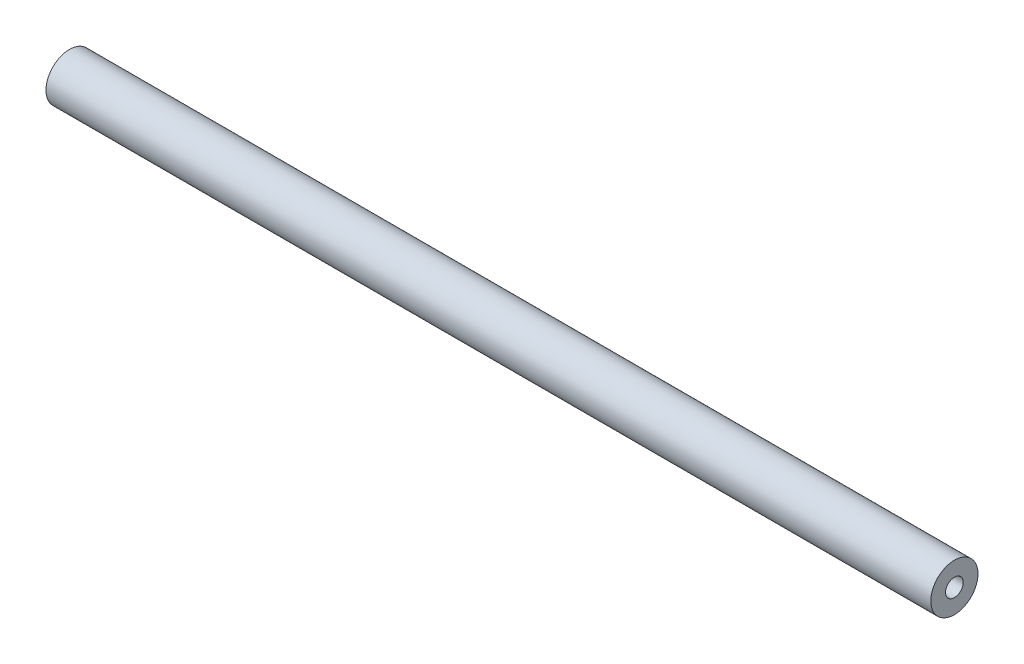
ISO-10303-21;
HEADER;
FILE_DESCRIPTION(('STEP AP214'),'2;1');
FILE_NAME('part.step','',(''),(''),'','','');
FILE_SCHEMA(('AUTOMOTIVE_DESIGN { 1 0 10303 214 1 1 1 1 }'));
ENDSEC;
DATA;
#1=APPLICATION_CONTEXT('core data for automotive mechanical design processes');
#2=APPLICATION_PROTOCOL_DEFINITION('international standard','automotive_design',2000,#1);
#3=PRODUCT_CONTEXT('',#1,'mechanical');
#4=PRODUCT('Part','Part','',(#3));
#5=PRODUCT_RELATED_PRODUCT_CATEGORY('part','',(#4));
#6=PRODUCT_DEFINITION_FORMATION('','',#4);
#7=PRODUCT_DEFINITION_CONTEXT('part definition',#1,'design');
#8=PRODUCT_DEFINITION('design','',#6,#7);
#9=PRODUCT_DEFINITION_SHAPE('','',#8);
#10=(LENGTH_UNIT() NAMED_UNIT(*) SI_UNIT(.MILLI.,.METRE.));
#11=(NAMED_UNIT(*) PLANE_ANGLE_UNIT() SI_UNIT($,.RADIAN.));
#12=(NAMED_UNIT(*) SI_UNIT($,.STERADIAN.) SOLID_ANGLE_UNIT());
#13=UNCERTAINTY_MEASURE_WITH_UNIT(LENGTH_MEASURE(1.E-05),#10,'distance_accuracy_value','');
#14=(GEOMETRIC_REPRESENTATION_CONTEXT(3) GLOBAL_UNCERTAINTY_ASSIGNED_CONTEXT((#13)) GLOBAL_UNIT_ASSIGNED_CONTEXT((#10,
#11,#12)) REPRESENTATION_CONTEXT('',''));
#15=CARTESIAN_POINT('',(0.,0.,0.));
#16=DIRECTION('',(0.,0.,1.));
#17=DIRECTION('',(1.,0.,0.));
#18=AXIS2_PLACEMENT_3D('',#15,#16,#17);
#19=CARTESIAN_POINT('',(0.,0.,0.));
#20=DIRECTION('',(1.,0.,0.));
#21=DIRECTION('',(0.,0.,-1.));
#22=AXIS2_PLACEMENT_3D('',#19,#20,#21);
#23=CYLINDRICAL_SURFACE('',#22,4.);
#24=CARTESIAN_POINT('',(0.,0.,0.));
#25=DIRECTION('',(1.,0.,0.));
#26=DIRECTION('',(0.,0.,-1.));
#27=AXIS2_PLACEMENT_3D('',#24,#25,#26);
#28=CIRCLE('',#27,4.);
#29=CARTESIAN_POINT('',(0.,0.,-4.));
#30=VERTEX_POINT('',#29);
#31=EDGE_CURVE('E10',#30,#30,#28,.T.);
#32=ORIENTED_EDGE('',*,*,#31,.T.);
#33=EDGE_LOOP('',(#32));
#34=FACE_BOUND('',#33,.T.);
#35=CARTESIAN_POINT('',(149.86,0.,0.));
#36=DIRECTION('',(1.,0.,0.));
#37=DIRECTION('',(0.,0.,-1.));
#38=AXIS2_PLACEMENT_3D('',#35,#36,#37);
#39=CIRCLE('',#38,4.);
#40=CARTESIAN_POINT('',(149.86,0.,-4.));
#41=VERTEX_POINT('',#40);
#42=EDGE_CURVE('E45',#41,#41,#39,.T.);
#43=ORIENTED_EDGE('',*,*,#42,.F.);
#44=EDGE_LOOP('',(#43));
#45=FACE_BOUND('',#44,.T.);
#46=ADVANCED_FACE('F31',(#34,#45),#23,.T.);
#47=CARTESIAN_POINT('',(0.,4.,0.));
#48=DIRECTION('',(-1.,0.,0.));
#49=DIRECTION('',(0.,0.,1.));
#50=AXIS2_PLACEMENT_3D('',#47,#48,#49);
#51=PLANE('',#50);
#52=CARTESIAN_POINT('',(0.,0.,0.));
#53=DIRECTION('',(1.,0.,0.));
#54=DIRECTION('',(0.,0.,-1.));
#55=AXIS2_PLACEMENT_3D('',#52,#53,#54);
#56=CIRCLE('',#55,1.5);
#57=CARTESIAN_POINT('',(0.,0.,-1.5));
#58=VERTEX_POINT('',#57);
#59=EDGE_CURVE('E37',#58,#58,#56,.T.);
#60=ORIENTED_EDGE('',*,*,#59,.T.);
#61=EDGE_LOOP('',(#60));
#62=FACE_BOUND('',#61,.T.);
#63=ORIENTED_EDGE('',*,*,#31,.F.);
#64=EDGE_LOOP('',(#63));
#65=FACE_BOUND('',#64,.T.);
#66=ADVANCED_FACE('F55',(#62,#65),#51,.T.);
#67=CARTESIAN_POINT('',(0.,0.,0.));
#68=DIRECTION('',(1.,0.,0.));
#69=DIRECTION('',(0.,0.,-1.));
#70=AXIS2_PLACEMENT_3D('',#67,#68,#69);
#71=CYLINDRICAL_SURFACE('',#70,1.5);
#72=CARTESIAN_POINT('',(149.86,0.,0.));
#73=DIRECTION('',(1.,0.,0.));
#74=DIRECTION('',(0.,0.,-1.));
#75=AXIS2_PLACEMENT_3D('',#72,#73,#74);
#76=CIRCLE('',#75,1.5);
#77=CARTESIAN_POINT('',(149.86,0.,-1.5));
#78=VERTEX_POINT('',#77);
#79=EDGE_CURVE('E41',#78,#78,#76,.T.);
#80=ORIENTED_EDGE('',*,*,#79,.T.);
#81=EDGE_LOOP('',(#80));
#82=FACE_BOUND('',#81,.T.);
#83=ORIENTED_EDGE('',*,*,#59,.F.);
#84=EDGE_LOOP('',(#83));
#85=FACE_BOUND('',#84,.T.);
#86=ADVANCED_FACE('F59',(#82,#85),#71,.F.);
#87=CARTESIAN_POINT('',(149.86,1.5,0.));
#88=DIRECTION('',(1.,0.,0.));
#89=DIRECTION('',(0.,0.,-1.));
#90=AXIS2_PLACEMENT_3D('',#87,#88,#89);
#91=PLANE('',#90);
#92=ORIENTED_EDGE('',*,*,#42,.T.);
#93=EDGE_LOOP('',(#92));
#94=FACE_BOUND('',#93,.T.);
#95=ORIENTED_EDGE('',*,*,#79,.F.);
#96=EDGE_LOOP('',(#95));
#97=FACE_BOUND('',#96,.T.);
#98=ADVANCED_FACE('F51',(#94,#97),#91,.T.);
#99=CLOSED_SHELL('',(#46,#66,#86,#98));
#100=MANIFOLD_SOLID_BREP('B2',#99);
#101=ADVANCED_BREP_SHAPE_REPRESENTATION('',(#18,#100),#14);
#102=SHAPE_DEFINITION_REPRESENTATION(#9,#101);
ENDSEC;
END-ISO-10303-21;
